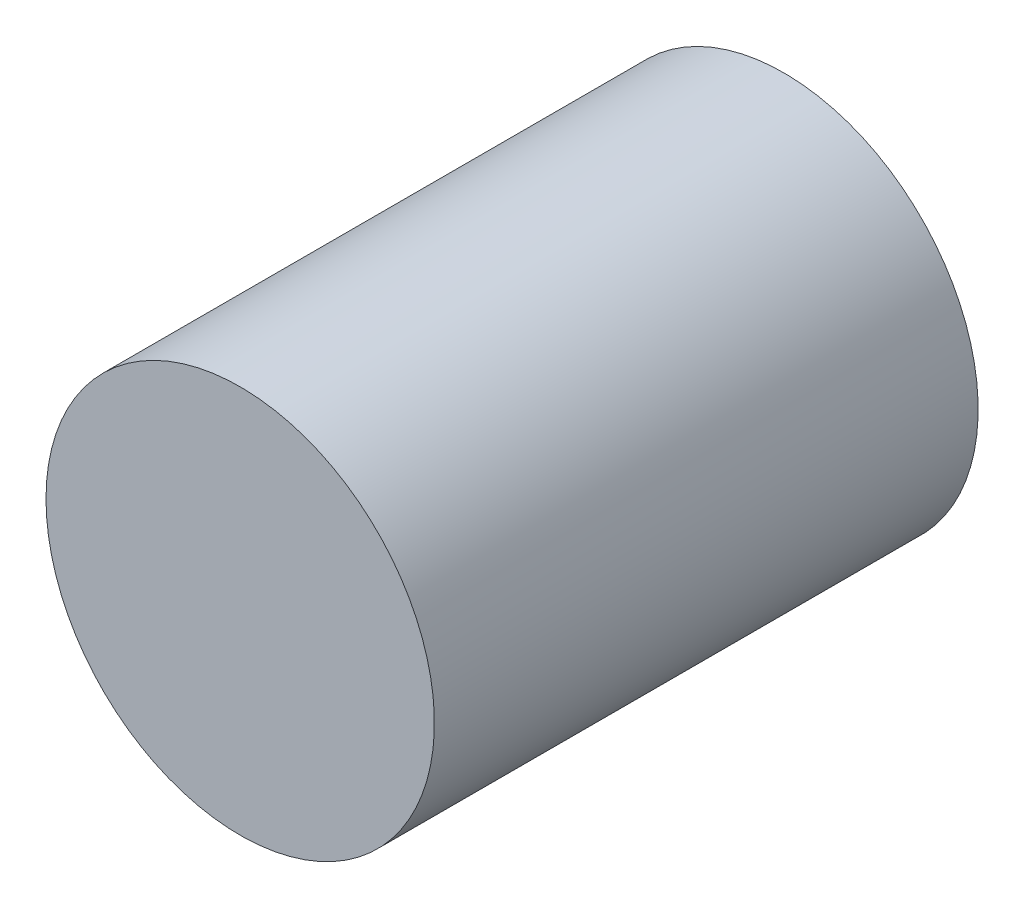
ISO-10303-21;
HEADER;
FILE_DESCRIPTION(('STEP AP214'),'2;1');
FILE_NAME('part.step','',(''),(''),'','','');
FILE_SCHEMA(('AUTOMOTIVE_DESIGN { 1 0 10303 214 1 1 1 1 }'));
ENDSEC;
DATA;
#1=APPLICATION_CONTEXT('core data for automotive mechanical design processes');
#2=APPLICATION_PROTOCOL_DEFINITION('international standard','automotive_design',2000,#1);
#3=PRODUCT_CONTEXT('',#1,'mechanical');
#4=PRODUCT('Part','Part','',(#3));
#5=PRODUCT_RELATED_PRODUCT_CATEGORY('part','',(#4));
#6=PRODUCT_DEFINITION_FORMATION('','',#4);
#7=PRODUCT_DEFINITION_CONTEXT('part definition',#1,'design');
#8=PRODUCT_DEFINITION('design','',#6,#7);
#9=PRODUCT_DEFINITION_SHAPE('','',#8);
#10=(LENGTH_UNIT() NAMED_UNIT(*) SI_UNIT(.MILLI.,.METRE.));
#11=(NAMED_UNIT(*) PLANE_ANGLE_UNIT() SI_UNIT($,.RADIAN.));
#12=(NAMED_UNIT(*) SI_UNIT($,.STERADIAN.) SOLID_ANGLE_UNIT());
#13=UNCERTAINTY_MEASURE_WITH_UNIT(LENGTH_MEASURE(1.E-05),#10,'distance_accuracy_value','');
#14=(GEOMETRIC_REPRESENTATION_CONTEXT(3) GLOBAL_UNCERTAINTY_ASSIGNED_CONTEXT((#13)) GLOBAL_UNIT_ASSIGNED_CONTEXT((#10,
#11,#12)) REPRESENTATION_CONTEXT('',''));
#15=CARTESIAN_POINT('',(0.,0.,0.));
#16=DIRECTION('',(0.,0.,1.));
#17=DIRECTION('',(1.,0.,0.));
#18=AXIS2_PLACEMENT_3D('',#15,#16,#17);
#19=CARTESIAN_POINT('',(0.,92.5,9.5));
#20=DIRECTION('',(0.,0.,-1.));
#21=DIRECTION('',(-1.,0.,0.));
#22=AXIS2_PLACEMENT_3D('',#19,#20,#21);
#23=CYLINDRICAL_SURFACE('',#22,5.);
#24=CARTESIAN_POINT('',(0.,92.5,9.5));
#25=DIRECTION('',(0.,0.,-1.));
#26=DIRECTION('',(-1.,0.,0.));
#27=AXIS2_PLACEMENT_3D('',#24,#25,#26);
#28=CIRCLE('',#27,5.);
#29=CARTESIAN_POINT('',(-5.,92.5,9.5));
#30=VERTEX_POINT('',#29);
#31=EDGE_CURVE('E10',#30,#30,#28,.T.);
#32=ORIENTED_EDGE('',*,*,#31,.T.);
#33=EDGE_LOOP('',(#32));
#34=FACE_BOUND('',#33,.T.);
#35=CARTESIAN_POINT('',(0.,92.5,-4.5));
#36=DIRECTION('',(0.,0.,-1.));
#37=DIRECTION('',(-1.,0.,0.));
#38=AXIS2_PLACEMENT_3D('',#35,#36,#37);
#39=CIRCLE('',#38,5.);
#40=CARTESIAN_POINT('',(-5.,92.5,-4.5));
#41=VERTEX_POINT('',#40);
#42=EDGE_CURVE('E43',#41,#41,#39,.T.);
#43=ORIENTED_EDGE('',*,*,#42,.F.);
#44=EDGE_LOOP('',(#43));
#45=FACE_BOUND('',#44,.T.);
#46=ADVANCED_FACE('F37',(#34,#45),#23,.T.);
#47=CARTESIAN_POINT('',(0.,92.5,9.5));
#48=DIRECTION('',(0.,0.,-1.));
#49=DIRECTION('',(-1.,0.,0.));
#50=AXIS2_PLACEMENT_3D('',#47,#48,#49);
#51=PLANE('',#50);
#52=ORIENTED_EDGE('',*,*,#31,.F.);
#53=EDGE_LOOP('',(#52));
#54=FACE_BOUND('',#53,.T.);
#55=ADVANCED_FACE('F52',(#54),#51,.F.);
#56=CARTESIAN_POINT('',(0.,92.5,-4.5));
#57=DIRECTION('',(0.,0.,-1.));
#58=DIRECTION('',(-1.,0.,0.));
#59=AXIS2_PLACEMENT_3D('',#56,#57,#58);
#60=PLANE('',#59);
#61=ORIENTED_EDGE('',*,*,#42,.T.);
#62=EDGE_LOOP('',(#61));
#63=FACE_BOUND('',#62,.T.);
#64=ADVANCED_FACE('F49',(#63),#60,.T.);
#65=CLOSED_SHELL('',(#46,#55,#64));
#66=MANIFOLD_SOLID_BREP('B2',#65);
#67=ADVANCED_BREP_SHAPE_REPRESENTATION('',(#18,#66),#14);
#68=SHAPE_DEFINITION_REPRESENTATION(#9,#67);
ENDSEC;
END-ISO-10303-21;
